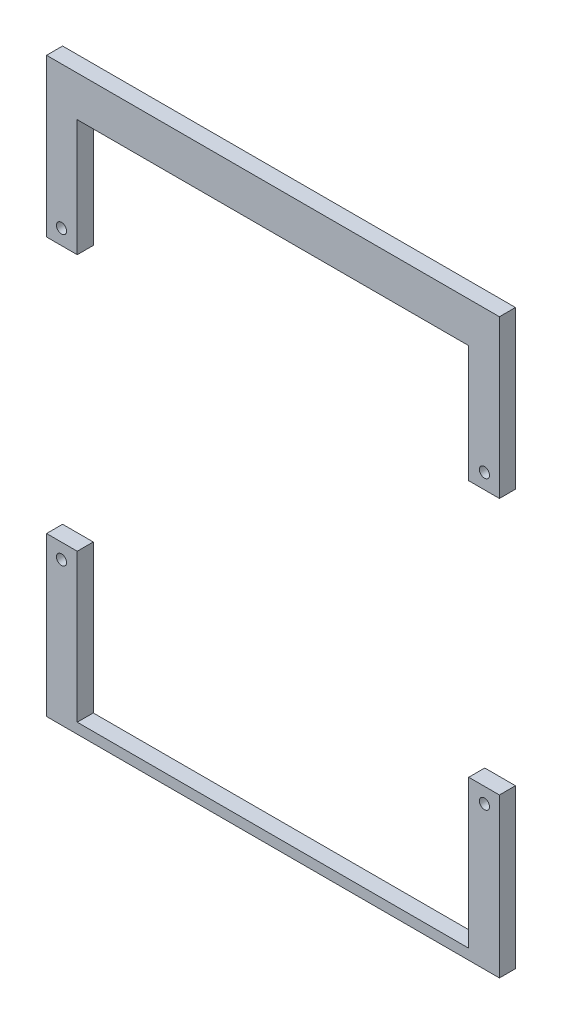
ISO-10303-21;
HEADER;
FILE_DESCRIPTION(('STEP AP214'),'2;1');
FILE_NAME('part.step','',(''),(''),'','','');
FILE_SCHEMA(('AUTOMOTIVE_DESIGN { 1 0 10303 214 1 1 1 1 }'));
ENDSEC;
DATA;
#1=APPLICATION_CONTEXT('core data for automotive mechanical design processes');
#2=APPLICATION_PROTOCOL_DEFINITION('international standard','automotive_design',2000,#1);
#3=PRODUCT_CONTEXT('',#1,'mechanical');
#4=PRODUCT('Part','Part','',(#3));
#5=PRODUCT_RELATED_PRODUCT_CATEGORY('part','',(#4));
#6=PRODUCT_DEFINITION_FORMATION('','',#4);
#7=PRODUCT_DEFINITION_CONTEXT('part definition',#1,'design');
#8=PRODUCT_DEFINITION('design','',#6,#7);
#9=PRODUCT_DEFINITION_SHAPE('','',#8);
#10=(LENGTH_UNIT() NAMED_UNIT(*) SI_UNIT(.MILLI.,.METRE.));
#11=(NAMED_UNIT(*) PLANE_ANGLE_UNIT() SI_UNIT($,.RADIAN.));
#12=(NAMED_UNIT(*) SI_UNIT($,.STERADIAN.) SOLID_ANGLE_UNIT());
#13=UNCERTAINTY_MEASURE_WITH_UNIT(LENGTH_MEASURE(1.E-05),#10,'distance_accuracy_value','');
#14=(GEOMETRIC_REPRESENTATION_CONTEXT(3) GLOBAL_UNCERTAINTY_ASSIGNED_CONTEXT((#13)) GLOBAL_UNIT_ASSIGNED_CONTEXT((#10,
#11,#12)) REPRESENTATION_CONTEXT('',''));
#15=CARTESIAN_POINT('',(0.,0.,0.));
#16=DIRECTION('',(0.,0.,1.));
#17=DIRECTION('',(1.,0.,0.));
#18=AXIS2_PLACEMENT_3D('',#15,#16,#17);
#19=CARTESIAN_POINT('',(-89.6514,0.,6.35));
#20=DIRECTION('',(1.,0.,0.));
#21=DIRECTION('',(0.,1.,0.));
#22=AXIS2_PLACEMENT_3D('',#19,#20,#21);
#23=PLANE('',#22);
#24=DIRECTION('',(0.,-1.,0.));
#25=VECTOR('',#24,1.);
#26=CARTESIAN_POINT('',(-89.6514,0.,0.));
#27=LINE('',#26,#25);
#28=CARTESIAN_POINT('',(-89.6514,119.3,0.));
#29=VERTEX_POINT('',#28);
#30=CARTESIAN_POINT('',(-89.6514,56.98,0.));
#31=VERTEX_POINT('',#30);
#32=EDGE_CURVE('E184',#29,#31,#27,.T.);
#33=ORIENTED_EDGE('',*,*,#32,.T.);
#34=DIRECTION('',(0.,0.,-1.));
#35=VECTOR('',#34,1.);
#36=CARTESIAN_POINT('',(-89.6514,56.98,6.35));
#37=LINE('',#36,#35);
#38=CARTESIAN_POINT('',(-89.6514,56.98,6.35));
#39=VERTEX_POINT('',#38);
#40=EDGE_CURVE('E12',#39,#31,#37,.T.);
#41=ORIENTED_EDGE('',*,*,#40,.F.);
#42=DIRECTION('',(0.,-1.,0.));
#43=VECTOR('',#42,1.);
#44=CARTESIAN_POINT('',(-89.6514,0.,6.35));
#45=LINE('',#44,#43);
#46=CARTESIAN_POINT('',(-89.6514,119.3,6.35));
#47=VERTEX_POINT('',#46);
#48=EDGE_CURVE('E171',#47,#39,#45,.T.);
#49=ORIENTED_EDGE('',*,*,#48,.F.);
#50=DIRECTION('',(0.,0.,-1.));
#51=VECTOR('',#50,1.);
#52=CARTESIAN_POINT('',(-89.6514,119.3,6.35));
#53=LINE('',#52,#51);
#54=EDGE_CURVE('E66',#47,#29,#53,.T.);
#55=ORIENTED_EDGE('',*,*,#54,.T.);
#56=EDGE_LOOP('',(#33,#41,#49,#55));
#57=FACE_BOUND('',#56,.T.);
#58=ADVANCED_FACE('F49',(#57),#23,.F.);
#59=CARTESIAN_POINT('',(0.,56.9799999999999,6.35));
#60=DIRECTION('',(0.,1.,0.));
#61=DIRECTION('',(-1.,0.,0.));
#62=AXIS2_PLACEMENT_3D('',#59,#60,#61);
#63=PLANE('',#62);
#64=DIRECTION('',(1.,0.,0.));
#65=VECTOR('',#64,1.);
#66=CARTESIAN_POINT('',(0.,56.9799999999999,0.));
#67=LINE('',#66,#65);
#68=CARTESIAN_POINT('',(-77.5,56.98,0.));
#69=VERTEX_POINT('',#68);
#70=EDGE_CURVE('E186',#31,#69,#67,.T.);
#71=ORIENTED_EDGE('',*,*,#70,.T.);
#72=DIRECTION('',(0.,0.,-1.));
#73=VECTOR('',#72,1.);
#74=CARTESIAN_POINT('',(-77.5,56.98,6.35));
#75=LINE('',#74,#73);
#76=CARTESIAN_POINT('',(-77.5,56.98,6.35));
#77=VERTEX_POINT('',#76);
#78=EDGE_CURVE('E58',#77,#69,#75,.T.);
#79=ORIENTED_EDGE('',*,*,#78,.F.);
#80=DIRECTION('',(1.,0.,0.));
#81=VECTOR('',#80,1.);
#82=CARTESIAN_POINT('',(0.,56.9799999999999,6.35));
#83=LINE('',#82,#81);
#84=EDGE_CURVE('E95',#39,#77,#83,.T.);
#85=ORIENTED_EDGE('',*,*,#84,.F.);
#86=ORIENTED_EDGE('',*,*,#40,.T.);
#87=EDGE_LOOP('',(#71,#79,#85,#86));
#88=FACE_BOUND('',#87,.T.);
#89=ADVANCED_FACE('F200',(#88),#63,.F.);
#90=CARTESIAN_POINT('',(-77.5,0.,6.35));
#91=DIRECTION('',(1.,0.,0.));
#92=DIRECTION('',(0.,1.,0.));
#93=AXIS2_PLACEMENT_3D('',#90,#91,#92);
#94=PLANE('',#93);
#95=DIRECTION('',(0.,-1.,0.));
#96=VECTOR('',#95,1.);
#97=CARTESIAN_POINT('',(-77.5,0.,0.));
#98=LINE('',#97,#96);
#99=CARTESIAN_POINT('',(-77.5,103.3,0.));
#100=VERTEX_POINT('',#99);
#101=EDGE_CURVE('E189',#100,#69,#98,.T.);
#102=ORIENTED_EDGE('',*,*,#101,.F.);
#103=DIRECTION('',(0.,0.,-1.));
#104=VECTOR('',#103,1.);
#105=CARTESIAN_POINT('',(-77.5,103.3,6.35));
#106=LINE('',#105,#104);
#107=CARTESIAN_POINT('',(-77.5,103.3,6.35));
#108=VERTEX_POINT('',#107);
#109=EDGE_CURVE('E84',#108,#100,#106,.T.);
#110=ORIENTED_EDGE('',*,*,#109,.F.);
#111=DIRECTION('',(0.,-1.,0.));
#112=VECTOR('',#111,1.);
#113=CARTESIAN_POINT('',(-77.5,0.,6.35));
#114=LINE('',#113,#112);
#115=EDGE_CURVE('E175',#108,#77,#114,.T.);
#116=ORIENTED_EDGE('',*,*,#115,.T.);
#117=ORIENTED_EDGE('',*,*,#78,.T.);
#118=EDGE_LOOP('',(#102,#110,#116,#117));
#119=FACE_BOUND('',#118,.T.);
#120=ADVANCED_FACE('F198',(#119),#94,.T.);
#121=CARTESIAN_POINT('',(0.,103.3,6.35));
#122=DIRECTION('',(0.,1.,0.));
#123=DIRECTION('',(0.,0.,1.));
#124=AXIS2_PLACEMENT_3D('',#121,#122,#123);
#125=PLANE('',#124);
#126=DIRECTION('',(1.,0.,0.));
#127=VECTOR('',#126,1.);
#128=CARTESIAN_POINT('',(0.,103.3,0.));
#129=LINE('',#128,#127);
#130=CARTESIAN_POINT('',(77.5,103.3,0.));
#131=VERTEX_POINT('',#130);
#132=EDGE_CURVE('E192',#100,#131,#129,.T.);
#133=ORIENTED_EDGE('',*,*,#132,.T.);
#134=DIRECTION('',(0.,0.,-1.));
#135=VECTOR('',#134,1.);
#136=CARTESIAN_POINT('',(77.5,103.3,6.35));
#137=LINE('',#136,#135);
#138=CARTESIAN_POINT('',(77.5,103.3,6.35));
#139=VERTEX_POINT('',#138);
#140=EDGE_CURVE('E164',#139,#131,#137,.T.);
#141=ORIENTED_EDGE('',*,*,#140,.F.);
#142=DIRECTION('',(1.,0.,0.));
#143=VECTOR('',#142,1.);
#144=CARTESIAN_POINT('',(0.,103.3,6.35));
#145=LINE('',#144,#143);
#146=EDGE_CURVE('E178',#108,#139,#145,.T.);
#147=ORIENTED_EDGE('',*,*,#146,.F.);
#148=ORIENTED_EDGE('',*,*,#109,.T.);
#149=EDGE_LOOP('',(#133,#141,#147,#148));
#150=FACE_BOUND('',#149,.T.);
#151=ADVANCED_FACE('F207',(#150),#125,.F.);
#152=CARTESIAN_POINT('',(-83.72,62.98,6.35));
#153=DIRECTION('',(0.,0.,-1.));
#154=DIRECTION('',(-1.,0.,0.));
#155=AXIS2_PLACEMENT_3D('',#152,#153,#154);
#156=CYLINDRICAL_SURFACE('',#155,2.);
#157=CARTESIAN_POINT('',(-83.72,62.98,6.35));
#158=DIRECTION('',(0.,0.,1.));
#159=DIRECTION('',(1.,0.,0.));
#160=AXIS2_PLACEMENT_3D('',#157,#158,#159);
#161=CIRCLE('',#160,2.);
#162=CARTESIAN_POINT('',(-81.72,62.98,6.35));
#163=VERTEX_POINT('',#162);
#164=EDGE_CURVE('E168',#163,#163,#161,.T.);
#165=ORIENTED_EDGE('',*,*,#164,.T.);
#166=EDGE_LOOP('',(#165));
#167=FACE_BOUND('',#166,.T.);
#168=CARTESIAN_POINT('',(-83.72,62.98,0.));
#169=DIRECTION('',(0.,0.,1.));
#170=DIRECTION('',(1.,0.,0.));
#171=AXIS2_PLACEMENT_3D('',#168,#169,#170);
#172=CIRCLE('',#171,2.);
#173=CARTESIAN_POINT('',(-81.72,62.98,0.));
#174=VERTEX_POINT('',#173);
#175=EDGE_CURVE('E143',#174,#174,#172,.T.);
#176=ORIENTED_EDGE('',*,*,#175,.F.);
#177=EDGE_LOOP('',(#176));
#178=FACE_BOUND('',#177,.T.);
#179=ADVANCED_FACE('F51',(#167,#178),#156,.F.);
#180=CARTESIAN_POINT('',(0.,119.3,6.35));
#181=DIRECTION('',(0.,1.,0.));
#182=DIRECTION('',(0.,0.,1.));
#183=AXIS2_PLACEMENT_3D('',#180,#181,#182);
#184=PLANE('',#183);
#185=DIRECTION('',(1.,0.,0.));
#186=VECTOR('',#185,1.);
#187=CARTESIAN_POINT('',(0.,119.3,0.));
#188=LINE('',#187,#186);
#189=CARTESIAN_POINT('',(89.6514,119.3,0.));
#190=VERTEX_POINT('',#189);
#191=EDGE_CURVE('E172',#29,#190,#188,.T.);
#192=ORIENTED_EDGE('',*,*,#191,.F.);
#193=ORIENTED_EDGE('',*,*,#54,.F.);
#194=DIRECTION('',(1.,0.,0.));
#195=VECTOR('',#194,1.);
#196=CARTESIAN_POINT('',(0.,119.3,6.35));
#197=LINE('',#196,#195);
#198=CARTESIAN_POINT('',(89.6514,119.3,6.35));
#199=VERTEX_POINT('',#198);
#200=EDGE_CURVE('E180',#47,#199,#197,.T.);
#201=ORIENTED_EDGE('',*,*,#200,.T.);
#202=DIRECTION('',(0.,0.,-1.));
#203=VECTOR('',#202,1.);
#204=CARTESIAN_POINT('',(89.6514,119.3,6.35));
#205=LINE('',#204,#203);
#206=EDGE_CURVE('E148',#199,#190,#205,.T.);
#207=ORIENTED_EDGE('',*,*,#206,.T.);
#208=EDGE_LOOP('',(#192,#193,#201,#207));
#209=FACE_BOUND('',#208,.T.);
#210=ADVANCED_FACE('F210',(#209),#184,.T.);
#211=CARTESIAN_POINT('',(0.,0.,6.35));
#212=DIRECTION('',(0.,0.,1.));
#213=DIRECTION('',(1.,0.,0.));
#214=AXIS2_PLACEMENT_3D('',#211,#212,#213);
#215=PLANE('',#214);
#216=ORIENTED_EDGE('',*,*,#164,.F.);
#217=EDGE_LOOP('',(#216));
#218=FACE_BOUND('',#217,.T.);
#219=ORIENTED_EDGE('',*,*,#48,.T.);
#220=ORIENTED_EDGE('',*,*,#84,.T.);
#221=ORIENTED_EDGE('',*,*,#115,.F.);
#222=ORIENTED_EDGE('',*,*,#146,.T.);
#223=DIRECTION('',(0.,-1.,0.));
#224=VECTOR('',#223,1.);
#225=CARTESIAN_POINT('',(77.5,0.,6.35));
#226=LINE('',#225,#224);
#227=CARTESIAN_POINT('',(77.5,56.98,6.35));
#228=VERTEX_POINT('',#227);
#229=EDGE_CURVE('E130',#139,#228,#226,.T.);
#230=ORIENTED_EDGE('',*,*,#229,.T.);
#231=DIRECTION('',(-1.,0.,0.));
#232=VECTOR('',#231,1.);
#233=CARTESIAN_POINT('',(0.,56.9799999999999,6.35));
#234=LINE('',#233,#232);
#235=CARTESIAN_POINT('',(89.6514,56.98,6.35));
#236=VERTEX_POINT('',#235);
#237=EDGE_CURVE('E121',#236,#228,#234,.T.);
#238=ORIENTED_EDGE('',*,*,#237,.F.);
#239=DIRECTION('',(0.,-1.,0.));
#240=VECTOR('',#239,1.);
#241=CARTESIAN_POINT('',(89.6514,0.,6.35));
#242=LINE('',#241,#240);
#243=EDGE_CURVE('E127',#199,#236,#242,.T.);
#244=ORIENTED_EDGE('',*,*,#243,.F.);
#245=ORIENTED_EDGE('',*,*,#200,.F.);
#246=EDGE_LOOP('',(#219,#220,#221,#222,#230,#238,#244,#245));
#247=FACE_BOUND('',#246,.T.);
#248=CARTESIAN_POINT('',(83.72,62.98,6.35));
#249=DIRECTION('',(0.,0.,-1.));
#250=DIRECTION('',(-1.,0.,0.));
#251=AXIS2_PLACEMENT_3D('',#248,#249,#250);
#252=CIRCLE('',#251,2.);
#253=CARTESIAN_POINT('',(81.72,62.98,6.35));
#254=VERTEX_POINT('',#253);
#255=EDGE_CURVE('E149',#254,#254,#252,.T.);
#256=ORIENTED_EDGE('',*,*,#255,.T.);
#257=EDGE_LOOP('',(#256));
#258=FACE_BOUND('',#257,.T.);
#259=ADVANCED_FACE('F123',(#218,#247,#258),#215,.T.);
#260=CARTESIAN_POINT('',(0.,0.,0.));
#261=DIRECTION('',(0.,0.,1.));
#262=DIRECTION('',(1.,0.,0.));
#263=AXIS2_PLACEMENT_3D('',#260,#261,#262);
#264=PLANE('',#263);
#265=ORIENTED_EDGE('',*,*,#175,.T.);
#266=EDGE_LOOP('',(#265));
#267=FACE_BOUND('',#266,.T.);
#268=ORIENTED_EDGE('',*,*,#32,.F.);
#269=ORIENTED_EDGE('',*,*,#191,.T.);
#270=DIRECTION('',(0.,-1.,0.));
#271=VECTOR('',#270,1.);
#272=CARTESIAN_POINT('',(89.6514,0.,0.));
#273=LINE('',#272,#271);
#274=CARTESIAN_POINT('',(89.6514,56.98,0.));
#275=VERTEX_POINT('',#274);
#276=EDGE_CURVE('E159',#190,#275,#273,.T.);
#277=ORIENTED_EDGE('',*,*,#276,.T.);
#278=DIRECTION('',(-1.,0.,0.));
#279=VECTOR('',#278,1.);
#280=CARTESIAN_POINT('',(0.,56.9799999999999,0.));
#281=LINE('',#280,#279);
#282=CARTESIAN_POINT('',(77.5,56.98,0.));
#283=VERTEX_POINT('',#282);
#284=EDGE_CURVE('E139',#275,#283,#281,.T.);
#285=ORIENTED_EDGE('',*,*,#284,.T.);
#286=DIRECTION('',(0.,-1.,0.));
#287=VECTOR('',#286,1.);
#288=CARTESIAN_POINT('',(77.5,0.,0.));
#289=LINE('',#288,#287);
#290=EDGE_CURVE('E152',#131,#283,#289,.T.);
#291=ORIENTED_EDGE('',*,*,#290,.F.);
#292=ORIENTED_EDGE('',*,*,#132,.F.);
#293=ORIENTED_EDGE('',*,*,#101,.T.);
#294=ORIENTED_EDGE('',*,*,#70,.F.);
#295=EDGE_LOOP('',(#268,#269,#277,#285,#291,#292,#293,#294));
#296=FACE_BOUND('',#295,.T.);
#297=CARTESIAN_POINT('',(83.72,62.98,0.));
#298=DIRECTION('',(0.,0.,-1.));
#299=DIRECTION('',(-1.,0.,0.));
#300=AXIS2_PLACEMENT_3D('',#297,#298,#299);
#301=CIRCLE('',#300,2.);
#302=CARTESIAN_POINT('',(81.72,62.98,0.));
#303=VERTEX_POINT('',#302);
#304=EDGE_CURVE('E156',#303,#303,#301,.T.);
#305=ORIENTED_EDGE('',*,*,#304,.F.);
#306=EDGE_LOOP('',(#305));
#307=FACE_BOUND('',#306,.T.);
#308=ADVANCED_FACE('F203',(#267,#296,#307),#264,.F.);
#309=CARTESIAN_POINT('',(89.6514,0.,6.35));
#310=DIRECTION('',(-1.,0.,0.));
#311=DIRECTION('',(0.,1.,0.));
#312=AXIS2_PLACEMENT_3D('',#309,#310,#311);
#313=PLANE('',#312);
#314=ORIENTED_EDGE('',*,*,#276,.F.);
#315=ORIENTED_EDGE('',*,*,#206,.F.);
#316=ORIENTED_EDGE('',*,*,#243,.T.);
#317=DIRECTION('',(0.,0.,-1.));
#318=VECTOR('',#317,1.);
#319=CARTESIAN_POINT('',(89.6514,56.98,6.35));
#320=LINE('',#319,#318);
#321=EDGE_CURVE('E136',#236,#275,#320,.T.);
#322=ORIENTED_EDGE('',*,*,#321,.T.);
#323=EDGE_LOOP('',(#314,#315,#316,#322));
#324=FACE_BOUND('',#323,.T.);
#325=ADVANCED_FACE('F146',(#324),#313,.F.);
#326=CARTESIAN_POINT('',(0.,56.9799999999999,6.35));
#327=DIRECTION('',(0.,1.,0.));
#328=DIRECTION('',(1.,0.,0.));
#329=AXIS2_PLACEMENT_3D('',#326,#327,#328);
#330=PLANE('',#329);
#331=ORIENTED_EDGE('',*,*,#284,.F.);
#332=ORIENTED_EDGE('',*,*,#321,.F.);
#333=ORIENTED_EDGE('',*,*,#237,.T.);
#334=DIRECTION('',(0.,0.,-1.));
#335=VECTOR('',#334,1.);
#336=CARTESIAN_POINT('',(77.5,56.98,6.35));
#337=LINE('',#336,#335);
#338=EDGE_CURVE('E144',#228,#283,#337,.T.);
#339=ORIENTED_EDGE('',*,*,#338,.T.);
#340=EDGE_LOOP('',(#331,#332,#333,#339));
#341=FACE_BOUND('',#340,.T.);
#342=ADVANCED_FACE('F137',(#341),#330,.F.);
#343=CARTESIAN_POINT('',(77.5,0.,6.35));
#344=DIRECTION('',(-1.,0.,0.));
#345=DIRECTION('',(0.,1.,0.));
#346=AXIS2_PLACEMENT_3D('',#343,#344,#345);
#347=PLANE('',#346);
#348=ORIENTED_EDGE('',*,*,#290,.T.);
#349=ORIENTED_EDGE('',*,*,#338,.F.);
#350=ORIENTED_EDGE('',*,*,#229,.F.);
#351=ORIENTED_EDGE('',*,*,#140,.T.);
#352=EDGE_LOOP('',(#348,#349,#350,#351));
#353=FACE_BOUND('',#352,.T.);
#354=ADVANCED_FACE('F209',(#353),#347,.T.);
#355=CARTESIAN_POINT('',(83.72,62.98,6.35));
#356=DIRECTION('',(0.,0.,-1.));
#357=DIRECTION('',(1.,0.,0.));
#358=AXIS2_PLACEMENT_3D('',#355,#356,#357);
#359=CYLINDRICAL_SURFACE('',#358,2.);
#360=ORIENTED_EDGE('',*,*,#255,.F.);
#361=EDGE_LOOP('',(#360));
#362=FACE_BOUND('',#361,.T.);
#363=ORIENTED_EDGE('',*,*,#304,.T.);
#364=EDGE_LOOP('',(#363));
#365=FACE_BOUND('',#364,.T.);
#366=ADVANCED_FACE('F229',(#362,#365),#359,.F.);
#367=CLOSED_SHELL('',(#58,#89,#120,#151,#179,#210,#259,#308,#325,#342,#354,#366));
#368=MANIFOLD_SOLID_BREP('B2',#367);
#369=CARTESIAN_POINT('',(-77.5,0.,6.35));
#370=DIRECTION('',(1.,0.,0.));
#371=DIRECTION('',(0.,1.,0.));
#372=AXIS2_PLACEMENT_3D('',#369,#370,#371);
#373=PLANE('',#372);
#374=DIRECTION('',(0.,-1.,0.));
#375=VECTOR('',#374,1.);
#376=CARTESIAN_POINT('',(-77.5,0.,0.));
#377=LINE('',#376,#375);
#378=CARTESIAN_POINT('',(-77.5,-44.6724,0.));
#379=VERTEX_POINT('',#378);
#380=CARTESIAN_POINT('',(-77.5,-103.3,0.));
#381=VERTEX_POINT('',#380);
#382=EDGE_CURVE('E453',#379,#381,#377,.T.);
#383=ORIENTED_EDGE('',*,*,#382,.F.);
#384=DIRECTION('',(0.,0.,-1.));
#385=VECTOR('',#384,1.);
#386=CARTESIAN_POINT('',(-77.5,-44.6724,6.35));
#387=LINE('',#386,#385);
#388=CARTESIAN_POINT('',(-77.5,-44.6724,6.35));
#389=VERTEX_POINT('',#388);
#390=EDGE_CURVE('E47',#389,#379,#387,.T.);
#391=ORIENTED_EDGE('',*,*,#390,.F.);
#392=DIRECTION('',(0.,-1.,0.));
#393=VECTOR('',#392,1.);
#394=CARTESIAN_POINT('',(-77.5,0.,6.35));
#395=LINE('',#394,#393);
#396=CARTESIAN_POINT('',(-77.5,-103.3,6.35));
#397=VERTEX_POINT('',#396);
#398=EDGE_CURVE('E438',#389,#397,#395,.T.);
#399=ORIENTED_EDGE('',*,*,#398,.T.);
#400=DIRECTION('',(0.,0.,-1.));
#401=VECTOR('',#400,1.);
#402=CARTESIAN_POINT('',(-77.5,-103.3,6.35));
#403=LINE('',#402,#401);
#404=EDGE_CURVE('E336',#397,#381,#403,.T.);
#405=ORIENTED_EDGE('',*,*,#404,.T.);
#406=EDGE_LOOP('',(#383,#391,#399,#405));
#407=FACE_BOUND('',#406,.T.);
#408=ADVANCED_FACE('F319',(#407),#373,.T.);
#409=CARTESIAN_POINT('',(0.,-44.6724000000001,6.35));
#410=DIRECTION('',(0.,-1.,0.));
#411=DIRECTION('',(1.,0.,0.));
#412=AXIS2_PLACEMENT_3D('',#409,#410,#411);
#413=PLANE('',#412);
#414=DIRECTION('',(-1.,0.,0.));
#415=VECTOR('',#414,1.);
#416=CARTESIAN_POINT('',(0.,-44.6724000000001,0.));
#417=LINE('',#416,#415);
#418=CARTESIAN_POINT('',(-89.6514,-44.6724,0.));
#419=VERTEX_POINT('',#418);
#420=EDGE_CURVE('E455',#379,#419,#417,.T.);
#421=ORIENTED_EDGE('',*,*,#420,.T.);
#422=DIRECTION('',(0.,0.,-1.));
#423=VECTOR('',#422,1.);
#424=CARTESIAN_POINT('',(-89.6514,-44.6724,6.35));
#425=LINE('',#424,#423);
#426=CARTESIAN_POINT('',(-89.6514,-44.6724,6.35));
#427=VERTEX_POINT('',#426);
#428=EDGE_CURVE('E328',#427,#419,#425,.T.);
#429=ORIENTED_EDGE('',*,*,#428,.F.);
#430=DIRECTION('',(-1.,0.,0.));
#431=VECTOR('',#430,1.);
#432=CARTESIAN_POINT('',(0.,-44.6724000000001,6.35));
#433=LINE('',#432,#431);
#434=EDGE_CURVE('E441',#389,#427,#433,.T.);
#435=ORIENTED_EDGE('',*,*,#434,.F.);
#436=ORIENTED_EDGE('',*,*,#390,.T.);
#437=EDGE_LOOP('',(#421,#429,#435,#436));
#438=FACE_BOUND('',#437,.T.);
#439=ADVANCED_FACE('F472',(#438),#413,.F.);
#440=CARTESIAN_POINT('',(-89.6514,0.,6.35));
#441=DIRECTION('',(1.,0.,0.));
#442=DIRECTION('',(0.,1.,0.));
#443=AXIS2_PLACEMENT_3D('',#440,#441,#442);
#444=PLANE('',#443);
#445=DIRECTION('',(0.,-1.,0.));
#446=VECTOR('',#445,1.);
#447=CARTESIAN_POINT('',(-89.6514,0.,0.));
#448=LINE('',#447,#446);
#449=CARTESIAN_POINT('',(-89.6514,-107.43,0.));
#450=VERTEX_POINT('',#449);
#451=EDGE_CURVE('E458',#419,#450,#448,.T.);
#452=ORIENTED_EDGE('',*,*,#451,.T.);
#453=DIRECTION('',(0.,0.,-1.));
#454=VECTOR('',#453,1.);
#455=CARTESIAN_POINT('',(-89.6514,-107.43,6.35));
#456=LINE('',#455,#454);
#457=CARTESIAN_POINT('',(-89.6514,-107.43,6.35));
#458=VERTEX_POINT('',#457);
#459=EDGE_CURVE('E464',#458,#450,#456,.T.);
#460=ORIENTED_EDGE('',*,*,#459,.F.);
#461=DIRECTION('',(0.,-1.,0.));
#462=VECTOR('',#461,1.);
#463=CARTESIAN_POINT('',(-89.6514,0.,6.35));
#464=LINE('',#463,#462);
#465=EDGE_CURVE('E444',#427,#458,#464,.T.);
#466=ORIENTED_EDGE('',*,*,#465,.F.);
#467=ORIENTED_EDGE('',*,*,#428,.T.);
#468=EDGE_LOOP('',(#452,#460,#466,#467));
#469=FACE_BOUND('',#468,.T.);
#470=ADVANCED_FACE('F468',(#469),#444,.F.);
#471=CARTESIAN_POINT('',(0.,-107.43,6.35));
#472=DIRECTION('',(0.,1.,0.));
#473=DIRECTION('',(0.,0.,1.));
#474=AXIS2_PLACEMENT_3D('',#471,#472,#473);
#475=PLANE('',#474);
#476=DIRECTION('',(1.,0.,0.));
#477=VECTOR('',#476,1.);
#478=CARTESIAN_POINT('',(0.,-107.43,0.));
#479=LINE('',#478,#477);
#480=CARTESIAN_POINT('',(89.6514,-107.43,0.));
#481=VERTEX_POINT('',#480);
#482=EDGE_CURVE('E353',#450,#481,#479,.T.);
#483=ORIENTED_EDGE('',*,*,#482,.T.);
#484=DIRECTION('',(0.,0.,-1.));
#485=VECTOR('',#484,1.);
#486=CARTESIAN_POINT('',(89.6514,-107.43,6.35));
#487=LINE('',#486,#485);
#488=CARTESIAN_POINT('',(89.6514,-107.43,6.35));
#489=VERTEX_POINT('',#488);
#490=EDGE_CURVE('E431',#489,#481,#487,.T.);
#491=ORIENTED_EDGE('',*,*,#490,.F.);
#492=DIRECTION('',(1.,0.,0.));
#493=VECTOR('',#492,1.);
#494=CARTESIAN_POINT('',(0.,-107.43,6.35));
#495=LINE('',#494,#493);
#496=EDGE_CURVE('E447',#458,#489,#495,.T.);
#497=ORIENTED_EDGE('',*,*,#496,.F.);
#498=ORIENTED_EDGE('',*,*,#459,.T.);
#499=EDGE_LOOP('',(#483,#491,#497,#498));
#500=FACE_BOUND('',#499,.T.);
#501=ADVANCED_FACE('F483',(#500),#475,.F.);
#502=CARTESIAN_POINT('',(-83.72,-50.6724,6.35));
#503=DIRECTION('',(0.,0.,-1.));
#504=DIRECTION('',(-1.,0.,0.));
#505=AXIS2_PLACEMENT_3D('',#502,#503,#504);
#506=CYLINDRICAL_SURFACE('',#505,2.);
#507=CARTESIAN_POINT('',(-83.72,-50.6724,6.35));
#508=DIRECTION('',(0.,0.,1.));
#509=DIRECTION('',(1.,0.,0.));
#510=AXIS2_PLACEMENT_3D('',#507,#508,#509);
#511=CIRCLE('',#510,2.);
#512=CARTESIAN_POINT('',(-81.72,-50.6724,6.35));
#513=VERTEX_POINT('',#512);
#514=EDGE_CURVE('E435',#513,#513,#511,.T.);
#515=ORIENTED_EDGE('',*,*,#514,.T.);
#516=EDGE_LOOP('',(#515));
#517=FACE_BOUND('',#516,.T.);
#518=CARTESIAN_POINT('',(-83.72,-50.6724,0.));
#519=DIRECTION('',(0.,0.,1.));
#520=DIRECTION('',(1.,0.,0.));
#521=AXIS2_PLACEMENT_3D('',#518,#519,#520);
#522=CIRCLE('',#521,2.);
#523=CARTESIAN_POINT('',(-81.72,-50.6724,0.));
#524=VERTEX_POINT('',#523);
#525=EDGE_CURVE('E410',#524,#524,#522,.T.);
#526=ORIENTED_EDGE('',*,*,#525,.F.);
#527=EDGE_LOOP('',(#526));
#528=FACE_BOUND('',#527,.T.);
#529=ADVANCED_FACE('F321',(#517,#528),#506,.F.);
#530=CARTESIAN_POINT('',(0.,-103.3,6.35));
#531=DIRECTION('',(0.,1.,0.));
#532=DIRECTION('',(0.,0.,1.));
#533=AXIS2_PLACEMENT_3D('',#530,#531,#532);
#534=PLANE('',#533);
#535=DIRECTION('',(1.,0.,0.));
#536=VECTOR('',#535,1.);
#537=CARTESIAN_POINT('',(0.,-103.3,0.));
#538=LINE('',#537,#536);
#539=CARTESIAN_POINT('',(77.5,-103.3,0.));
#540=VERTEX_POINT('',#539);
#541=EDGE_CURVE('E439',#381,#540,#538,.T.);
#542=ORIENTED_EDGE('',*,*,#541,.F.);
#543=ORIENTED_EDGE('',*,*,#404,.F.);
#544=DIRECTION('',(1.,0.,0.));
#545=VECTOR('',#544,1.);
#546=CARTESIAN_POINT('',(0.,-103.3,6.35));
#547=LINE('',#546,#545);
#548=CARTESIAN_POINT('',(77.5,-103.3,6.35));
#549=VERTEX_POINT('',#548);
#550=EDGE_CURVE('E449',#397,#549,#547,.T.);
#551=ORIENTED_EDGE('',*,*,#550,.T.);
#552=DIRECTION('',(0.,0.,-1.));
#553=VECTOR('',#552,1.);
#554=CARTESIAN_POINT('',(77.5,-103.3,6.35));
#555=LINE('',#554,#553);
#556=EDGE_CURVE('E415',#549,#540,#555,.T.);
#557=ORIENTED_EDGE('',*,*,#556,.T.);
#558=EDGE_LOOP('',(#542,#543,#551,#557));
#559=FACE_BOUND('',#558,.T.);
#560=ADVANCED_FACE('F487',(#559),#534,.T.);
#561=CARTESIAN_POINT('',(0.,0.,6.35));
#562=DIRECTION('',(0.,0.,1.));
#563=DIRECTION('',(1.,0.,0.));
#564=AXIS2_PLACEMENT_3D('',#561,#562,#563);
#565=PLANE('',#564);
#566=ORIENTED_EDGE('',*,*,#514,.F.);
#567=EDGE_LOOP('',(#566));
#568=FACE_BOUND('',#567,.T.);
#569=ORIENTED_EDGE('',*,*,#398,.F.);
#570=ORIENTED_EDGE('',*,*,#434,.T.);
#571=ORIENTED_EDGE('',*,*,#465,.T.);
#572=ORIENTED_EDGE('',*,*,#496,.T.);
#573=DIRECTION('',(0.,-1.,0.));
#574=VECTOR('',#573,1.);
#575=CARTESIAN_POINT('',(89.6514,0.,6.35));
#576=LINE('',#575,#574);
#577=CARTESIAN_POINT('',(89.6514,-44.6724,6.35));
#578=VERTEX_POINT('',#577);
#579=EDGE_CURVE('E397',#578,#489,#576,.T.);
#580=ORIENTED_EDGE('',*,*,#579,.F.);
#581=DIRECTION('',(1.,0.,0.));
#582=VECTOR('',#581,1.);
#583=CARTESIAN_POINT('',(0.,-44.6724000000001,6.35));
#584=LINE('',#583,#582);
#585=CARTESIAN_POINT('',(77.5,-44.6724,6.35));
#586=VERTEX_POINT('',#585);
#587=EDGE_CURVE('E387',#586,#578,#584,.T.);
#588=ORIENTED_EDGE('',*,*,#587,.F.);
#589=DIRECTION('',(0.,-1.,0.));
#590=VECTOR('',#589,1.);
#591=CARTESIAN_POINT('',(77.5,0.,6.35));
#592=LINE('',#591,#590);
#593=EDGE_CURVE('E394',#586,#549,#592,.T.);
#594=ORIENTED_EDGE('',*,*,#593,.T.);
#595=ORIENTED_EDGE('',*,*,#550,.F.);
#596=EDGE_LOOP('',(#569,#570,#571,#572,#580,#588,#594,#595));
#597=FACE_BOUND('',#596,.T.);
#598=CARTESIAN_POINT('',(83.72,-50.6724,6.35));
#599=DIRECTION('',(0.,0.,-1.));
#600=DIRECTION('',(-1.,0.,0.));
#601=AXIS2_PLACEMENT_3D('',#598,#599,#600);
#602=CIRCLE('',#601,2.);
#603=CARTESIAN_POINT('',(81.72,-50.6724,6.35));
#604=VERTEX_POINT('',#603);
#605=EDGE_CURVE('E416',#604,#604,#602,.T.);
#606=ORIENTED_EDGE('',*,*,#605,.T.);
#607=EDGE_LOOP('',(#606));
#608=FACE_BOUND('',#607,.T.);
#609=ADVANCED_FACE('F390',(#568,#597,#608),#565,.T.);
#610=CARTESIAN_POINT('',(0.,0.,0.));
#611=DIRECTION('',(0.,0.,1.));
#612=DIRECTION('',(1.,0.,0.));
#613=AXIS2_PLACEMENT_3D('',#610,#611,#612);
#614=PLANE('',#613);
#615=ORIENTED_EDGE('',*,*,#525,.T.);
#616=EDGE_LOOP('',(#615));
#617=FACE_BOUND('',#616,.T.);
#618=ORIENTED_EDGE('',*,*,#382,.T.);
#619=ORIENTED_EDGE('',*,*,#541,.T.);
#620=DIRECTION('',(0.,-1.,0.));
#621=VECTOR('',#620,1.);
#622=CARTESIAN_POINT('',(77.5,0.,0.));
#623=LINE('',#622,#621);
#624=CARTESIAN_POINT('',(77.5,-44.6724,0.));
#625=VERTEX_POINT('',#624);
#626=EDGE_CURVE('E426',#625,#540,#623,.T.);
#627=ORIENTED_EDGE('',*,*,#626,.F.);
#628=DIRECTION('',(1.,0.,0.));
#629=VECTOR('',#628,1.);
#630=CARTESIAN_POINT('',(0.,-44.6724000000001,0.));
#631=LINE('',#630,#629);
#632=CARTESIAN_POINT('',(89.6514,-44.6724,0.));
#633=VERTEX_POINT('',#632);
#634=EDGE_CURVE('E406',#625,#633,#631,.T.);
#635=ORIENTED_EDGE('',*,*,#634,.T.);
#636=DIRECTION('',(0.,-1.,0.));
#637=VECTOR('',#636,1.);
#638=CARTESIAN_POINT('',(89.6514,0.,0.));
#639=LINE('',#638,#637);
#640=EDGE_CURVE('E419',#633,#481,#639,.T.);
#641=ORIENTED_EDGE('',*,*,#640,.T.);
#642=ORIENTED_EDGE('',*,*,#482,.F.);
#643=ORIENTED_EDGE('',*,*,#451,.F.);
#644=ORIENTED_EDGE('',*,*,#420,.F.);
#645=EDGE_LOOP('',(#618,#619,#627,#635,#641,#642,#643,#644));
#646=FACE_BOUND('',#645,.T.);
#647=CARTESIAN_POINT('',(83.72,-50.6724,0.));
#648=DIRECTION('',(0.,0.,-1.));
#649=DIRECTION('',(-1.,0.,0.));
#650=AXIS2_PLACEMENT_3D('',#647,#648,#649);
#651=CIRCLE('',#650,2.);
#652=CARTESIAN_POINT('',(81.72,-50.6724,0.));
#653=VERTEX_POINT('',#652);
#654=EDGE_CURVE('E423',#653,#653,#651,.T.);
#655=ORIENTED_EDGE('',*,*,#654,.F.);
#656=EDGE_LOOP('',(#655));
#657=FACE_BOUND('',#656,.T.);
#658=ADVANCED_FACE('F473',(#617,#646,#657),#614,.F.);
#659=CARTESIAN_POINT('',(77.5,0.,6.35));
#660=DIRECTION('',(-1.,0.,0.));
#661=DIRECTION('',(0.,1.,0.));
#662=AXIS2_PLACEMENT_3D('',#659,#660,#661);
#663=PLANE('',#662);
#664=ORIENTED_EDGE('',*,*,#626,.T.);
#665=ORIENTED_EDGE('',*,*,#556,.F.);
#666=ORIENTED_EDGE('',*,*,#593,.F.);
#667=DIRECTION('',(0.,0.,-1.));
#668=VECTOR('',#667,1.);
#669=CARTESIAN_POINT('',(77.5,-44.6724,6.35));
#670=LINE('',#669,#668);
#671=EDGE_CURVE('E403',#586,#625,#670,.T.);
#672=ORIENTED_EDGE('',*,*,#671,.T.);
#673=EDGE_LOOP('',(#664,#665,#666,#672));
#674=FACE_BOUND('',#673,.T.);
#675=ADVANCED_FACE('F413',(#674),#663,.T.);
#676=CARTESIAN_POINT('',(0.,-44.6724000000001,6.35));
#677=DIRECTION('',(0.,-1.,0.));
#678=DIRECTION('',(-1.,0.,0.));
#679=AXIS2_PLACEMENT_3D('',#676,#677,#678);
#680=PLANE('',#679);
#681=ORIENTED_EDGE('',*,*,#634,.F.);
#682=ORIENTED_EDGE('',*,*,#671,.F.);
#683=ORIENTED_EDGE('',*,*,#587,.T.);
#684=DIRECTION('',(0.,0.,-1.));
#685=VECTOR('',#684,1.);
#686=CARTESIAN_POINT('',(89.6514,-44.6724,6.35));
#687=LINE('',#686,#685);
#688=EDGE_CURVE('E411',#578,#633,#687,.T.);
#689=ORIENTED_EDGE('',*,*,#688,.T.);
#690=EDGE_LOOP('',(#681,#682,#683,#689));
#691=FACE_BOUND('',#690,.T.);
#692=ADVANCED_FACE('F404',(#691),#680,.F.);
#693=CARTESIAN_POINT('',(89.6514,0.,6.35));
#694=DIRECTION('',(-1.,0.,0.));
#695=DIRECTION('',(0.,1.,0.));
#696=AXIS2_PLACEMENT_3D('',#693,#694,#695);
#697=PLANE('',#696);
#698=ORIENTED_EDGE('',*,*,#640,.F.);
#699=ORIENTED_EDGE('',*,*,#688,.F.);
#700=ORIENTED_EDGE('',*,*,#579,.T.);
#701=ORIENTED_EDGE('',*,*,#490,.T.);
#702=EDGE_LOOP('',(#698,#699,#700,#701));
#703=FACE_BOUND('',#702,.T.);
#704=ADVANCED_FACE('F499',(#703),#697,.F.);
#705=CARTESIAN_POINT('',(83.72,-50.6724,6.35));
#706=DIRECTION('',(0.,0.,-1.));
#707=DIRECTION('',(1.,0.,0.));
#708=AXIS2_PLACEMENT_3D('',#705,#706,#707);
#709=CYLINDRICAL_SURFACE('',#708,2.);
#710=ORIENTED_EDGE('',*,*,#605,.F.);
#711=EDGE_LOOP('',(#710));
#712=FACE_BOUND('',#711,.T.);
#713=ORIENTED_EDGE('',*,*,#654,.T.);
#714=EDGE_LOOP('',(#713));
#715=FACE_BOUND('',#714,.T.);
#716=ADVANCED_FACE('F496',(#712,#715),#709,.F.);
#717=CLOSED_SHELL('',(#408,#439,#470,#501,#529,#560,#609,#658,#675,#692,#704,#716));
#718=MANIFOLD_SOLID_BREP('B6',#717);
#719=ADVANCED_BREP_SHAPE_REPRESENTATION('',(#18,#368,#718),#14);
#720=SHAPE_DEFINITION_REPRESENTATION(#9,#719);
ENDSEC;
END-ISO-10303-21;
